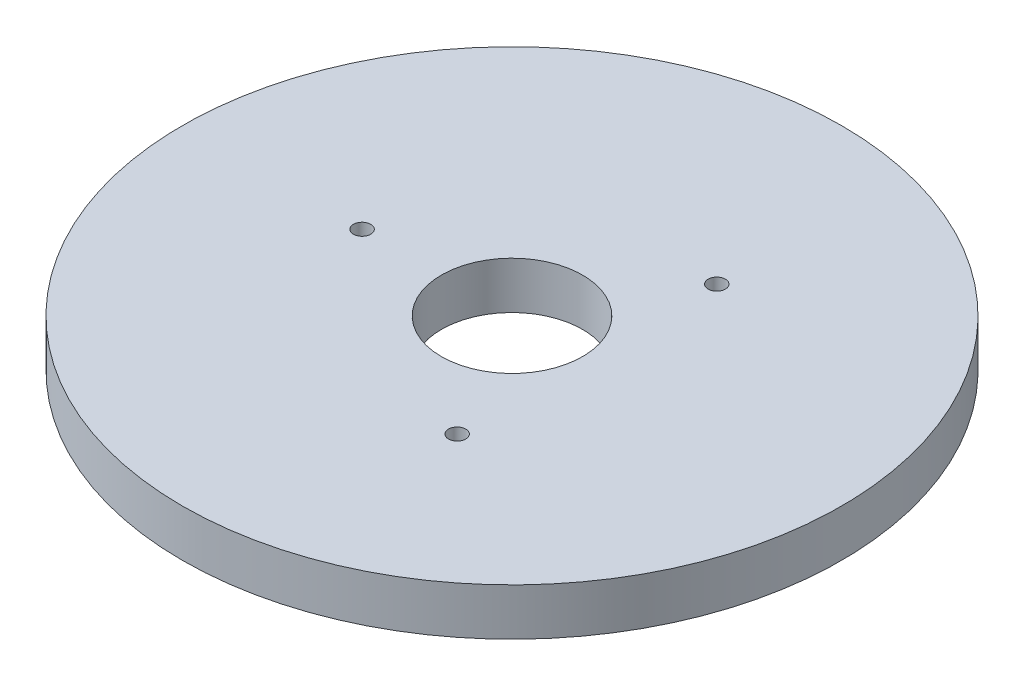
ISO-10303-21;
HEADER;
FILE_DESCRIPTION(('STEP AP214'),'2;1');
FILE_NAME('part.step','',(''),(''),'','','');
FILE_SCHEMA(('AUTOMOTIVE_DESIGN { 1 0 10303 214 1 1 1 1 }'));
ENDSEC;
DATA;
#1=APPLICATION_CONTEXT('core data for automotive mechanical design processes');
#2=APPLICATION_PROTOCOL_DEFINITION('international standard','automotive_design',2000,#1);
#3=PRODUCT_CONTEXT('',#1,'mechanical');
#4=PRODUCT('Part','Part','',(#3));
#5=PRODUCT_RELATED_PRODUCT_CATEGORY('part','',(#4));
#6=PRODUCT_DEFINITION_FORMATION('','',#4);
#7=PRODUCT_DEFINITION_CONTEXT('part definition',#1,'design');
#8=PRODUCT_DEFINITION('design','',#6,#7);
#9=PRODUCT_DEFINITION_SHAPE('','',#8);
#10=(LENGTH_UNIT() NAMED_UNIT(*) SI_UNIT(.MILLI.,.METRE.));
#11=(NAMED_UNIT(*) PLANE_ANGLE_UNIT() SI_UNIT($,.RADIAN.));
#12=(NAMED_UNIT(*) SI_UNIT($,.STERADIAN.) SOLID_ANGLE_UNIT());
#13=UNCERTAINTY_MEASURE_WITH_UNIT(LENGTH_MEASURE(1.E-05),#10,'distance_accuracy_value','');
#14=(GEOMETRIC_REPRESENTATION_CONTEXT(3) GLOBAL_UNCERTAINTY_ASSIGNED_CONTEXT((#13)) GLOBAL_UNIT_ASSIGNED_CONTEXT((#10,
#11,#12)) REPRESENTATION_CONTEXT('',''));
#15=CARTESIAN_POINT('',(0.,0.,0.));
#16=DIRECTION('',(0.,0.,1.));
#17=DIRECTION('',(1.,0.,0.));
#18=AXIS2_PLACEMENT_3D('',#15,#16,#17);
#19=CARTESIAN_POINT('',(0.,10.,0.));
#20=DIRECTION('',(0.,-1.,0.));
#21=DIRECTION('',(0.,0.,-1.));
#22=AXIS2_PLACEMENT_3D('',#19,#20,#21);
#23=CYLINDRICAL_SURFACE('',#22,70.);
#24=CARTESIAN_POINT('',(0.,10.,0.));
#25=DIRECTION('',(0.,1.,0.));
#26=DIRECTION('',(0.,0.,1.));
#27=AXIS2_PLACEMENT_3D('',#24,#25,#26);
#28=CIRCLE('',#27,70.);
#29=CARTESIAN_POINT('',(0.,10.,70.));
#30=VERTEX_POINT('',#29);
#31=EDGE_CURVE('E10',#30,#30,#28,.T.);
#32=ORIENTED_EDGE('',*,*,#31,.F.);
#33=EDGE_LOOP('',(#32));
#34=FACE_BOUND('',#33,.T.);
#35=CARTESIAN_POINT('',(0.,0.,0.));
#36=DIRECTION('',(0.,1.,0.));
#37=DIRECTION('',(0.,0.,1.));
#38=AXIS2_PLACEMENT_3D('',#35,#36,#37);
#39=CIRCLE('',#38,70.);
#40=CARTESIAN_POINT('',(0.,0.,70.));
#41=VERTEX_POINT('',#40);
#42=EDGE_CURVE('E37',#41,#41,#39,.T.);
#43=ORIENTED_EDGE('',*,*,#42,.T.);
#44=EDGE_LOOP('',(#43));
#45=FACE_BOUND('',#44,.T.);
#46=ADVANCED_FACE('F40',(#34,#45),#23,.T.);
#47=CARTESIAN_POINT('',(0.,10.,0.));
#48=DIRECTION('',(0.,1.,0.));
#49=DIRECTION('',(0.,0.,1.));
#50=AXIS2_PLACEMENT_3D('',#47,#48,#49);
#51=PLANE('',#50);
#52=CARTESIAN_POINT('',(15.9208030942504,10.,27.5756398565412));
#53=DIRECTION('',(0.,1.,0.));
#54=DIRECTION('',(0.866025403784436,0.,-0.500000000000004));
#55=AXIS2_PLACEMENT_3D('',#52,#53,#54);
#56=CIRCLE('',#55,1.83635610224986);
#57=CARTESIAN_POINT('',(17.5111341291933,10.,26.6574618054163));
#58=VERTEX_POINT('',#57);
#59=EDGE_CURVE('E70',#58,#58,#56,.T.);
#60=ORIENTED_EDGE('',*,*,#59,.F.);
#61=EDGE_LOOP('',(#60));
#62=FACE_BOUND('',#61,.T.);
#63=CARTESIAN_POINT('',(15.92080309425,10.,-27.5756398565414));
#64=DIRECTION('',(0.,1.,0.));
#65=DIRECTION('',(-0.866025403784443,0.,-0.499999999999992));
#66=AXIS2_PLACEMENT_3D('',#63,#64,#65);
#67=CIRCLE('',#66,1.83635610224986);
#68=CARTESIAN_POINT('',(14.3304720593071,10.,-28.4938179076663));
#69=VERTEX_POINT('',#68);
#70=EDGE_CURVE('E61',#69,#69,#67,.T.);
#71=ORIENTED_EDGE('',*,*,#70,.F.);
#72=EDGE_LOOP('',(#71));
#73=FACE_BOUND('',#72,.T.);
#74=CARTESIAN_POINT('',(-31.8416061885005,10.,0.));
#75=DIRECTION('',(0.,1.,0.));
#76=DIRECTION('',(0.,0.,1.));
#77=AXIS2_PLACEMENT_3D('',#74,#75,#76);
#78=CIRCLE('',#77,1.83635610224986);
#79=CARTESIAN_POINT('',(-31.8416061885005,10.,1.83635610224986));
#80=VERTEX_POINT('',#79);
#81=EDGE_CURVE('E54',#80,#80,#78,.T.);
#82=ORIENTED_EDGE('',*,*,#81,.F.);
#83=EDGE_LOOP('',(#82));
#84=FACE_BOUND('',#83,.T.);
#85=CARTESIAN_POINT('',(0.,10.,0.));
#86=DIRECTION('',(0.,1.,0.));
#87=DIRECTION('',(0.,0.,1.));
#88=AXIS2_PLACEMENT_3D('',#85,#86,#87);
#89=CIRCLE('',#88,15.);
#90=CARTESIAN_POINT('',(0.,10.,15.));
#91=VERTEX_POINT('',#90);
#92=EDGE_CURVE('E50',#91,#91,#89,.T.);
#93=ORIENTED_EDGE('',*,*,#92,.F.);
#94=EDGE_LOOP('',(#93));
#95=FACE_BOUND('',#94,.T.);
#96=ORIENTED_EDGE('',*,*,#31,.T.);
#97=EDGE_LOOP('',(#96));
#98=FACE_BOUND('',#97,.T.);
#99=ADVANCED_FACE('F85',(#62,#73,#84,#95,#98),#51,.T.);
#100=CARTESIAN_POINT('',(0.,0.,0.));
#101=DIRECTION('',(0.,1.,0.));
#102=DIRECTION('',(0.,0.,1.));
#103=AXIS2_PLACEMENT_3D('',#100,#101,#102);
#104=PLANE('',#103);
#105=CARTESIAN_POINT('',(0.,0.,0.));
#106=DIRECTION('',(0.,1.,0.));
#107=DIRECTION('',(0.,0.,1.));
#108=AXIS2_PLACEMENT_3D('',#105,#106,#107);
#109=CIRCLE('',#108,15.);
#110=CARTESIAN_POINT('',(0.,0.,15.));
#111=VERTEX_POINT('',#110);
#112=EDGE_CURVE('E47',#111,#111,#109,.T.);
#113=ORIENTED_EDGE('',*,*,#112,.T.);
#114=EDGE_LOOP('',(#113));
#115=FACE_BOUND('',#114,.T.);
#116=ORIENTED_EDGE('',*,*,#42,.F.);
#117=EDGE_LOOP('',(#116));
#118=FACE_BOUND('',#117,.T.);
#119=ADVANCED_FACE('F84',(#115,#118),#104,.F.);
#120=CARTESIAN_POINT('',(0.,10.,0.));
#121=DIRECTION('',(0.,-1.,0.));
#122=DIRECTION('',(0.,0.,-1.));
#123=AXIS2_PLACEMENT_3D('',#120,#121,#122);
#124=CYLINDRICAL_SURFACE('',#123,15.);
#125=ORIENTED_EDGE('',*,*,#92,.T.);
#126=EDGE_LOOP('',(#125));
#127=FACE_BOUND('',#126,.T.);
#128=ORIENTED_EDGE('',*,*,#112,.F.);
#129=EDGE_LOOP('',(#128));
#130=FACE_BOUND('',#129,.T.);
#131=ADVANCED_FACE('F91',(#127,#130),#124,.F.);
#132=CARTESIAN_POINT('',(-31.8416061885005,3.02063514430654,0.));
#133=DIRECTION('',(0.,1.,0.));
#134=DIRECTION('',(0.,0.,1.));
#135=AXIS2_PLACEMENT_3D('',#132,#133,#134);
#136=CYLINDRICAL_SURFACE('',#135,1.83635610224986);
#137=CARTESIAN_POINT('',(-31.8416061885005,3.02063514430654,0.));
#138=DIRECTION('',(0.,1.,0.));
#139=DIRECTION('',(0.,0.,1.));
#140=AXIS2_PLACEMENT_3D('',#137,#138,#139);
#141=CIRCLE('',#140,1.83635610224986);
#142=CARTESIAN_POINT('',(-31.8416061885005,3.02063514430654,1.83635610224986));
#143=VERTEX_POINT('',#142);
#144=EDGE_CURVE('E55',#143,#143,#141,.T.);
#145=ORIENTED_EDGE('',*,*,#144,.F.);
#146=EDGE_LOOP('',(#145));
#147=FACE_BOUND('',#146,.T.);
#148=ORIENTED_EDGE('',*,*,#81,.T.);
#149=EDGE_LOOP('',(#148));
#150=FACE_BOUND('',#149,.T.);
#151=ADVANCED_FACE('F96',(#147,#150),#136,.F.);
#152=CARTESIAN_POINT('',(-31.8416061885005,3.02063514430654,0.));
#153=DIRECTION('',(0.,1.,0.));
#154=DIRECTION('',(0.,0.,1.));
#155=AXIS2_PLACEMENT_3D('',#152,#153,#154);
#156=PLANE('',#155);
#157=ORIENTED_EDGE('',*,*,#144,.T.);
#158=EDGE_LOOP('',(#157));
#159=FACE_BOUND('',#158,.T.);
#160=ADVANCED_FACE('F127',(#159),#156,.T.);
#161=CARTESIAN_POINT('',(15.92080309425,3.02063514430654,-27.5756398565414));
#162=DIRECTION('',(0.,1.,0.));
#163=DIRECTION('',(0.,0.,1.));
#164=AXIS2_PLACEMENT_3D('',#161,#162,#163);
#165=CYLINDRICAL_SURFACE('',#164,1.83635610224986);
#166=CARTESIAN_POINT('',(15.92080309425,3.02063514430654,-27.5756398565414));
#167=DIRECTION('',(0.,1.,0.));
#168=DIRECTION('',(-0.866025403784443,0.,-0.499999999999992));
#169=AXIS2_PLACEMENT_3D('',#166,#167,#168);
#170=CIRCLE('',#169,1.83635610224986);
#171=CARTESIAN_POINT('',(14.3304720593071,3.02063514430654,-28.4938179076663));
#172=VERTEX_POINT('',#171);
#173=EDGE_CURVE('E63',#172,#172,#170,.T.);
#174=ORIENTED_EDGE('',*,*,#173,.F.);
#175=EDGE_LOOP('',(#174));
#176=FACE_BOUND('',#175,.T.);
#177=ORIENTED_EDGE('',*,*,#70,.T.);
#178=EDGE_LOOP('',(#177));
#179=FACE_BOUND('',#178,.T.);
#180=ADVANCED_FACE('F133',(#176,#179),#165,.F.);
#181=CARTESIAN_POINT('',(15.92080309425,3.02063514430654,-27.5756398565414));
#182=DIRECTION('',(0.,1.,0.));
#183=DIRECTION('',(-0.866025403784443,0.,-0.499999999999992));
#184=AXIS2_PLACEMENT_3D('',#181,#182,#183);
#185=PLANE('',#184);
#186=ORIENTED_EDGE('',*,*,#173,.T.);
#187=EDGE_LOOP('',(#186));
#188=FACE_BOUND('',#187,.T.);
#189=ADVANCED_FACE('F77',(#188),#185,.T.);
#190=CARTESIAN_POINT('',(15.9208030942504,3.02063514430654,27.5756398565412));
#191=DIRECTION('',(0.,1.,0.));
#192=DIRECTION('',(0.,0.,1.));
#193=AXIS2_PLACEMENT_3D('',#190,#191,#192);
#194=CYLINDRICAL_SURFACE('',#193,1.83635610224986);
#195=CARTESIAN_POINT('',(15.9208030942504,3.02063514430654,27.5756398565412));
#196=DIRECTION('',(0.,1.,0.));
#197=DIRECTION('',(0.866025403784436,0.,-0.500000000000004));
#198=AXIS2_PLACEMENT_3D('',#195,#196,#197);
#199=CIRCLE('',#198,1.83635610224986);
#200=CARTESIAN_POINT('',(17.5111341291933,3.02063514430654,26.6574618054163));
#201=VERTEX_POINT('',#200);
#202=EDGE_CURVE('E59',#201,#201,#199,.T.);
#203=ORIENTED_EDGE('',*,*,#202,.F.);
#204=EDGE_LOOP('',(#203));
#205=FACE_BOUND('',#204,.T.);
#206=ORIENTED_EDGE('',*,*,#59,.T.);
#207=EDGE_LOOP('',(#206));
#208=FACE_BOUND('',#207,.T.);
#209=ADVANCED_FACE('F73',(#205,#208),#194,.F.);
#210=CARTESIAN_POINT('',(15.9208030942504,3.02063514430654,27.5756398565412));
#211=DIRECTION('',(0.,1.,0.));
#212=DIRECTION('',(0.866025403784436,0.,-0.500000000000004));
#213=AXIS2_PLACEMENT_3D('',#210,#211,#212);
#214=PLANE('',#213);
#215=ORIENTED_EDGE('',*,*,#202,.T.);
#216=EDGE_LOOP('',(#215));
#217=FACE_BOUND('',#216,.T.);
#218=ADVANCED_FACE('F71',(#217),#214,.T.);
#219=CLOSED_SHELL('',(#46,#99,#119,#131,#151,#160,#180,#189,#209,#218));
#220=MANIFOLD_SOLID_BREP('B2',#219);
#221=ADVANCED_BREP_SHAPE_REPRESENTATION('',(#18,#220),#14);
#222=SHAPE_DEFINITION_REPRESENTATION(#9,#221);
ENDSEC;
END-ISO-10303-21;
